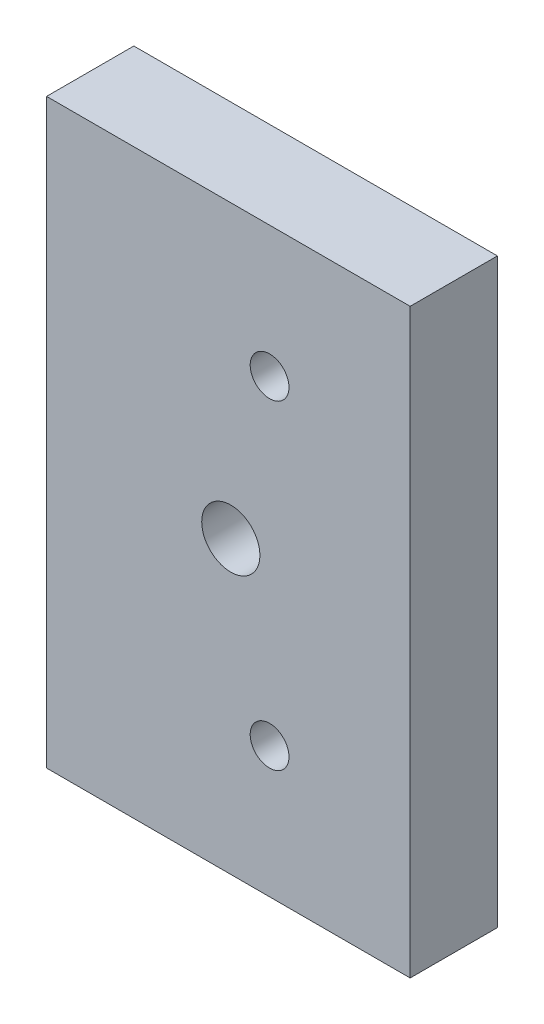
ISO-10303-21;
HEADER;
FILE_DESCRIPTION(('STEP AP214'),'2;1');
FILE_NAME('part.step','',(''),(''),'','','');
FILE_SCHEMA(('AUTOMOTIVE_DESIGN { 1 0 10303 214 1 1 1 1 }'));
ENDSEC;
DATA;
#1=APPLICATION_CONTEXT('core data for automotive mechanical design processes');
#2=APPLICATION_PROTOCOL_DEFINITION('international standard','automotive_design',2000,#1);
#3=PRODUCT_CONTEXT('',#1,'mechanical');
#4=PRODUCT('Part','Part','',(#3));
#5=PRODUCT_RELATED_PRODUCT_CATEGORY('part','',(#4));
#6=PRODUCT_DEFINITION_FORMATION('','',#4);
#7=PRODUCT_DEFINITION_CONTEXT('part definition',#1,'design');
#8=PRODUCT_DEFINITION('design','',#6,#7);
#9=PRODUCT_DEFINITION_SHAPE('','',#8);
#10=(LENGTH_UNIT() NAMED_UNIT(*) SI_UNIT(.MILLI.,.METRE.));
#11=(NAMED_UNIT(*) PLANE_ANGLE_UNIT() SI_UNIT($,.RADIAN.));
#12=(NAMED_UNIT(*) SI_UNIT($,.STERADIAN.) SOLID_ANGLE_UNIT());
#13=UNCERTAINTY_MEASURE_WITH_UNIT(LENGTH_MEASURE(1.E-05),#10,'distance_accuracy_value','');
#14=(GEOMETRIC_REPRESENTATION_CONTEXT(3) GLOBAL_UNCERTAINTY_ASSIGNED_CONTEXT((#13)) GLOBAL_UNIT_ASSIGNED_CONTEXT((#10,
#11,#12)) REPRESENTATION_CONTEXT('',''));
#15=CARTESIAN_POINT('',(0.,0.,0.));
#16=DIRECTION('',(0.,0.,1.));
#17=DIRECTION('',(1.,0.,0.));
#18=AXIS2_PLACEMENT_3D('',#15,#16,#17);
#19=CARTESIAN_POINT('',(0.,0.,18.));
#20=DIRECTION('',(0.,0.,1.));
#21=DIRECTION('',(1.,0.,0.));
#22=AXIS2_PLACEMENT_3D('',#19,#20,#21);
#23=PLANE('',#22);
#24=CARTESIAN_POINT('',(0.499999999999994,0.,18.));
#25=DIRECTION('',(0.,0.,-1.));
#26=DIRECTION('',(-1.,0.,0.));
#27=AXIS2_PLACEMENT_3D('',#24,#25,#26);
#28=CIRCLE('',#27,5.99999999999999);
#29=CARTESIAN_POINT('',(-5.49999999999999,0.,18.));
#30=VERTEX_POINT('',#29);
#31=EDGE_CURVE('E121',#30,#30,#28,.T.);
#32=ORIENTED_EDGE('',*,*,#31,.T.);
#33=EDGE_LOOP('',(#32));
#34=FACE_BOUND('',#33,.T.);
#35=CARTESIAN_POINT('',(8.49999999999999,33.,18.));
#36=DIRECTION('',(0.,0.,1.));
#37=DIRECTION('',(1.,0.,0.));
#38=AXIS2_PLACEMENT_3D('',#35,#36,#37);
#39=CIRCLE('',#38,4.);
#40=CARTESIAN_POINT('',(12.5,33.,18.));
#41=VERTEX_POINT('',#40);
#42=EDGE_CURVE('E100',#41,#41,#39,.T.);
#43=ORIENTED_EDGE('',*,*,#42,.F.);
#44=EDGE_LOOP('',(#43));
#45=FACE_BOUND('',#44,.T.);
#46=DIRECTION('',(0.,1.,0.));
#47=VECTOR('',#46,1.);
#48=CARTESIAN_POINT('',(37.5,60.,18.));
#49=LINE('',#48,#47);
#50=CARTESIAN_POINT('',(37.5,-60.,18.));
#51=VERTEX_POINT('',#50);
#52=CARTESIAN_POINT('',(37.5,60.,18.));
#53=VERTEX_POINT('',#52);
#54=EDGE_CURVE('E85',#51,#53,#49,.T.);
#55=ORIENTED_EDGE('',*,*,#54,.T.);
#56=DIRECTION('',(-1.,0.,0.));
#57=VECTOR('',#56,1.);
#58=CARTESIAN_POINT('',(-37.5,60.,18.));
#59=LINE('',#58,#57);
#60=CARTESIAN_POINT('',(-37.5,60.,18.));
#61=VERTEX_POINT('',#60);
#62=EDGE_CURVE('E80',#53,#61,#59,.T.);
#63=ORIENTED_EDGE('',*,*,#62,.T.);
#64=DIRECTION('',(0.,-1.,0.));
#65=VECTOR('',#64,1.);
#66=CARTESIAN_POINT('',(-37.5,60.,18.));
#67=LINE('',#66,#65);
#68=CARTESIAN_POINT('',(-37.5,-60.,18.));
#69=VERTEX_POINT('',#68);
#70=EDGE_CURVE('E83',#61,#69,#67,.T.);
#71=ORIENTED_EDGE('',*,*,#70,.T.);
#72=DIRECTION('',(1.,0.,0.));
#73=VECTOR('',#72,1.);
#74=CARTESIAN_POINT('',(-37.5,-60.,18.));
#75=LINE('',#74,#73);
#76=EDGE_CURVE('E50',#69,#51,#75,.T.);
#77=ORIENTED_EDGE('',*,*,#76,.T.);
#78=EDGE_LOOP('',(#55,#63,#71,#77));
#79=FACE_BOUND('',#78,.T.);
#80=CARTESIAN_POINT('',(8.50000000000001,-33.,18.));
#81=DIRECTION('',(0.,0.,1.));
#82=DIRECTION('',(1.,0.,0.));
#83=AXIS2_PLACEMENT_3D('',#80,#81,#82);
#84=CIRCLE('',#83,4.);
#85=CARTESIAN_POINT('',(12.5,-33.,18.));
#86=VERTEX_POINT('',#85);
#87=EDGE_CURVE('E115',#86,#86,#84,.T.);
#88=ORIENTED_EDGE('',*,*,#87,.F.);
#89=EDGE_LOOP('',(#88));
#90=FACE_BOUND('',#89,.T.);
#91=ADVANCED_FACE('F33',(#34,#45,#79,#90),#23,.T.);
#92=CARTESIAN_POINT('',(0.,0.,0.));
#93=DIRECTION('',(0.,0.,1.));
#94=DIRECTION('',(1.,0.,0.));
#95=AXIS2_PLACEMENT_3D('',#92,#93,#94);
#96=PLANE('',#95);
#97=CARTESIAN_POINT('',(0.499999999999994,0.,0.));
#98=DIRECTION('',(0.,0.,-1.));
#99=DIRECTION('',(-1.,0.,0.));
#100=AXIS2_PLACEMENT_3D('',#97,#98,#99);
#101=CIRCLE('',#100,5.99999999999999);
#102=CARTESIAN_POINT('',(-5.49999999999999,0.,0.));
#103=VERTEX_POINT('',#102);
#104=EDGE_CURVE('E126',#103,#103,#101,.T.);
#105=ORIENTED_EDGE('',*,*,#104,.F.);
#106=EDGE_LOOP('',(#105));
#107=FACE_BOUND('',#106,.T.);
#108=DIRECTION('',(0.,1.,0.));
#109=VECTOR('',#108,1.);
#110=CARTESIAN_POINT('',(37.5,60.,0.));
#111=LINE('',#110,#109);
#112=CARTESIAN_POINT('',(37.5,-60.,0.));
#113=VERTEX_POINT('',#112);
#114=CARTESIAN_POINT('',(37.5,60.,0.));
#115=VERTEX_POINT('',#114);
#116=EDGE_CURVE('E97',#113,#115,#111,.T.);
#117=ORIENTED_EDGE('',*,*,#116,.F.);
#118=DIRECTION('',(1.,0.,0.));
#119=VECTOR('',#118,1.);
#120=CARTESIAN_POINT('',(-37.5,-60.,0.));
#121=LINE('',#120,#119);
#122=CARTESIAN_POINT('',(-37.5,-60.,0.));
#123=VERTEX_POINT('',#122);
#124=EDGE_CURVE('E73',#123,#113,#121,.T.);
#125=ORIENTED_EDGE('',*,*,#124,.F.);
#126=DIRECTION('',(0.,-1.,0.));
#127=VECTOR('',#126,1.);
#128=CARTESIAN_POINT('',(-37.5,60.,0.));
#129=LINE('',#128,#127);
#130=CARTESIAN_POINT('',(-37.5,60.,0.));
#131=VERTEX_POINT('',#130);
#132=EDGE_CURVE('E67',#131,#123,#129,.T.);
#133=ORIENTED_EDGE('',*,*,#132,.F.);
#134=DIRECTION('',(-1.,0.,0.));
#135=VECTOR('',#134,1.);
#136=CARTESIAN_POINT('',(-37.5,60.,0.));
#137=LINE('',#136,#135);
#138=EDGE_CURVE('E89',#115,#131,#137,.T.);
#139=ORIENTED_EDGE('',*,*,#138,.F.);
#140=EDGE_LOOP('',(#117,#125,#133,#139));
#141=FACE_BOUND('',#140,.T.);
#142=CARTESIAN_POINT('',(8.49999999999999,33.,0.));
#143=DIRECTION('',(0.,0.,1.));
#144=DIRECTION('',(1.,0.,0.));
#145=AXIS2_PLACEMENT_3D('',#142,#143,#144);
#146=CIRCLE('',#145,4.);
#147=CARTESIAN_POINT('',(12.5,33.,0.));
#148=VERTEX_POINT('',#147);
#149=EDGE_CURVE('E112',#148,#148,#146,.T.);
#150=ORIENTED_EDGE('',*,*,#149,.T.);
#151=EDGE_LOOP('',(#150));
#152=FACE_BOUND('',#151,.T.);
#153=CARTESIAN_POINT('',(8.50000000000001,-33.,0.));
#154=DIRECTION('',(0.,0.,1.));
#155=DIRECTION('',(1.,0.,0.));
#156=AXIS2_PLACEMENT_3D('',#153,#154,#155);
#157=CIRCLE('',#156,4.);
#158=CARTESIAN_POINT('',(12.5,-33.,0.));
#159=VERTEX_POINT('',#158);
#160=EDGE_CURVE('E118',#159,#159,#157,.T.);
#161=ORIENTED_EDGE('',*,*,#160,.T.);
#162=EDGE_LOOP('',(#161));
#163=FACE_BOUND('',#162,.T.);
#164=ADVANCED_FACE('F108',(#107,#141,#152,#163),#96,.F.);
#165=CARTESIAN_POINT('',(37.5,60.,18.));
#166=DIRECTION('',(-1.,0.,0.));
#167=DIRECTION('',(0.,-1.,0.));
#168=AXIS2_PLACEMENT_3D('',#165,#166,#167);
#169=PLANE('',#168);
#170=ORIENTED_EDGE('',*,*,#116,.T.);
#171=DIRECTION('',(0.,0.,-1.));
#172=VECTOR('',#171,1.);
#173=CARTESIAN_POINT('',(37.5,60.,18.));
#174=LINE('',#173,#172);
#175=EDGE_CURVE('E11',#53,#115,#174,.T.);
#176=ORIENTED_EDGE('',*,*,#175,.F.);
#177=ORIENTED_EDGE('',*,*,#54,.F.);
#178=DIRECTION('',(0.,0.,-1.));
#179=VECTOR('',#178,1.);
#180=CARTESIAN_POINT('',(37.5,-60.,18.));
#181=LINE('',#180,#179);
#182=EDGE_CURVE('E93',#51,#113,#181,.T.);
#183=ORIENTED_EDGE('',*,*,#182,.T.);
#184=EDGE_LOOP('',(#170,#176,#177,#183));
#185=FACE_BOUND('',#184,.T.);
#186=ADVANCED_FACE('F35',(#185),#169,.F.);
#187=CARTESIAN_POINT('',(-37.5,60.,18.));
#188=DIRECTION('',(0.,-1.,0.));
#189=DIRECTION('',(0.,0.,-1.));
#190=AXIS2_PLACEMENT_3D('',#187,#188,#189);
#191=PLANE('',#190);
#192=ORIENTED_EDGE('',*,*,#138,.T.);
#193=DIRECTION('',(0.,0.,-1.));
#194=VECTOR('',#193,1.);
#195=CARTESIAN_POINT('',(-37.5,60.,18.));
#196=LINE('',#195,#194);
#197=EDGE_CURVE('E42',#61,#131,#196,.T.);
#198=ORIENTED_EDGE('',*,*,#197,.F.);
#199=ORIENTED_EDGE('',*,*,#62,.F.);
#200=ORIENTED_EDGE('',*,*,#175,.T.);
#201=EDGE_LOOP('',(#192,#198,#199,#200));
#202=FACE_BOUND('',#201,.T.);
#203=ADVANCED_FACE('F88',(#202),#191,.F.);
#204=CARTESIAN_POINT('',(-37.5,60.,18.));
#205=DIRECTION('',(1.,0.,0.));
#206=DIRECTION('',(0.,1.,0.));
#207=AXIS2_PLACEMENT_3D('',#204,#205,#206);
#208=PLANE('',#207);
#209=ORIENTED_EDGE('',*,*,#132,.T.);
#210=DIRECTION('',(0.,0.,-1.));
#211=VECTOR('',#210,1.);
#212=CARTESIAN_POINT('',(-37.5,-60.,18.));
#213=LINE('',#212,#211);
#214=EDGE_CURVE('E90',#69,#123,#213,.T.);
#215=ORIENTED_EDGE('',*,*,#214,.F.);
#216=ORIENTED_EDGE('',*,*,#70,.F.);
#217=ORIENTED_EDGE('',*,*,#197,.T.);
#218=EDGE_LOOP('',(#209,#215,#216,#217));
#219=FACE_BOUND('',#218,.T.);
#220=ADVANCED_FACE('F91',(#219),#208,.F.);
#221=CARTESIAN_POINT('',(-37.5,-60.,18.));
#222=DIRECTION('',(0.,1.,0.));
#223=DIRECTION('',(0.,0.,1.));
#224=AXIS2_PLACEMENT_3D('',#221,#222,#223);
#225=PLANE('',#224);
#226=ORIENTED_EDGE('',*,*,#124,.T.);
#227=ORIENTED_EDGE('',*,*,#182,.F.);
#228=ORIENTED_EDGE('',*,*,#76,.F.);
#229=ORIENTED_EDGE('',*,*,#214,.T.);
#230=EDGE_LOOP('',(#226,#227,#228,#229));
#231=FACE_BOUND('',#230,.T.);
#232=ADVANCED_FACE('F105',(#231),#225,.F.);
#233=CARTESIAN_POINT('',(8.49999999999999,33.,18.));
#234=DIRECTION('',(0.,0.,-1.));
#235=DIRECTION('',(-1.,0.,0.));
#236=AXIS2_PLACEMENT_3D('',#233,#234,#235);
#237=CYLINDRICAL_SURFACE('',#236,4.);
#238=ORIENTED_EDGE('',*,*,#42,.T.);
#239=EDGE_LOOP('',(#238));
#240=FACE_BOUND('',#239,.T.);
#241=ORIENTED_EDGE('',*,*,#149,.F.);
#242=EDGE_LOOP('',(#241));
#243=FACE_BOUND('',#242,.T.);
#244=ADVANCED_FACE('F144',(#240,#243),#237,.F.);
#245=CARTESIAN_POINT('',(8.50000000000001,-33.,18.));
#246=DIRECTION('',(0.,0.,-1.));
#247=DIRECTION('',(-1.,0.,0.));
#248=AXIS2_PLACEMENT_3D('',#245,#246,#247);
#249=CYLINDRICAL_SURFACE('',#248,4.);
#250=ORIENTED_EDGE('',*,*,#87,.T.);
#251=EDGE_LOOP('',(#250));
#252=FACE_BOUND('',#251,.T.);
#253=ORIENTED_EDGE('',*,*,#160,.F.);
#254=EDGE_LOOP('',(#253));
#255=FACE_BOUND('',#254,.T.);
#256=ADVANCED_FACE('F165',(#252,#255),#249,.F.);
#257=CARTESIAN_POINT('',(0.499999999999994,0.,0.));
#258=DIRECTION('',(0.,0.,-1.));
#259=DIRECTION('',(-1.,0.,0.));
#260=AXIS2_PLACEMENT_3D('',#257,#258,#259);
#261=CYLINDRICAL_SURFACE('',#260,5.99999999999999);
#262=ORIENTED_EDGE('',*,*,#31,.F.);
#263=EDGE_LOOP('',(#262));
#264=FACE_BOUND('',#263,.T.);
#265=ORIENTED_EDGE('',*,*,#104,.T.);
#266=EDGE_LOOP('',(#265));
#267=FACE_BOUND('',#266,.T.);
#268=ADVANCED_FACE('F130',(#264,#267),#261,.F.);
#269=CLOSED_SHELL('',(#91,#164,#186,#203,#220,#232,#244,#256,#268));
#270=MANIFOLD_SOLID_BREP('B2',#269);
#271=ADVANCED_BREP_SHAPE_REPRESENTATION('',(#18,#270),#14);
#272=SHAPE_DEFINITION_REPRESENTATION(#9,#271);
ENDSEC;
END-ISO-10303-21;
